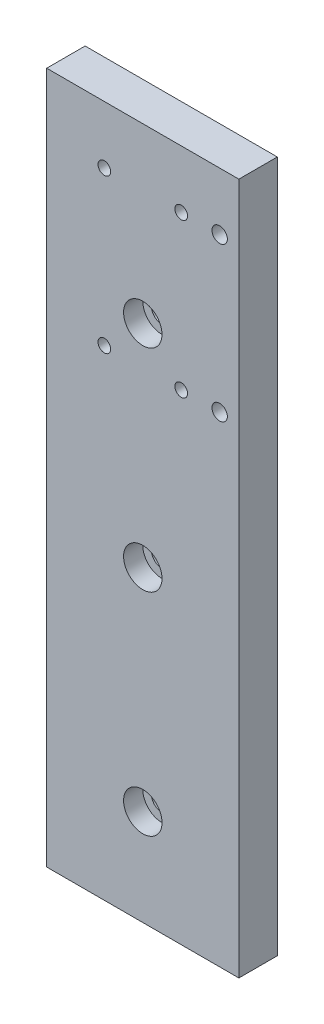
ISO-10303-21;
HEADER;
FILE_DESCRIPTION(('STEP AP214'),'2;1');
FILE_NAME('part.step','',(''),(''),'','','');
FILE_SCHEMA(('AUTOMOTIVE_DESIGN { 1 0 10303 214 1 1 1 1 }'));
ENDSEC;
DATA;
#1=APPLICATION_CONTEXT('core data for automotive mechanical design processes');
#2=APPLICATION_PROTOCOL_DEFINITION('international standard','automotive_design',2000,#1);
#3=PRODUCT_CONTEXT('',#1,'mechanical');
#4=PRODUCT('Part','Part','',(#3));
#5=PRODUCT_RELATED_PRODUCT_CATEGORY('part','',(#4));
#6=PRODUCT_DEFINITION_FORMATION('','',#4);
#7=PRODUCT_DEFINITION_CONTEXT('part definition',#1,'design');
#8=PRODUCT_DEFINITION('design','',#6,#7);
#9=PRODUCT_DEFINITION_SHAPE('','',#8);
#10=(LENGTH_UNIT() NAMED_UNIT(*) SI_UNIT(.MILLI.,.METRE.));
#11=(NAMED_UNIT(*) PLANE_ANGLE_UNIT() SI_UNIT($,.RADIAN.));
#12=(NAMED_UNIT(*) SI_UNIT($,.STERADIAN.) SOLID_ANGLE_UNIT());
#13=UNCERTAINTY_MEASURE_WITH_UNIT(LENGTH_MEASURE(1.E-05),#10,'distance_accuracy_value','');
#14=(GEOMETRIC_REPRESENTATION_CONTEXT(3) GLOBAL_UNCERTAINTY_ASSIGNED_CONTEXT((#13)) GLOBAL_UNIT_ASSIGNED_CONTEXT((#10,
#11,#12)) REPRESENTATION_CONTEXT('',''));
#15=CARTESIAN_POINT('',(0.,0.,0.));
#16=DIRECTION('',(0.,0.,1.));
#17=DIRECTION('',(1.,0.,0.));
#18=AXIS2_PLACEMENT_3D('',#15,#16,#17);
#19=CARTESIAN_POINT('',(-10.9813084112149,-119.193925233645,10.));
#20=DIRECTION('',(0.,0.,-1.));
#21=DIRECTION('',(-1.,0.,0.));
#22=AXIS2_PLACEMENT_3D('',#19,#20,#21);
#23=CYLINDRICAL_SURFACE('',#22,2.75);
#24=CARTESIAN_POINT('',(-10.9813084112149,-119.193925233645,0.));
#25=DIRECTION('',(0.,0.,1.));
#26=DIRECTION('',(1.,0.,0.));
#27=AXIS2_PLACEMENT_3D('',#24,#25,#26);
#28=CIRCLE('',#27,2.75);
#29=CARTESIAN_POINT('',(-8.23130841121492,-119.193925233645,0.));
#30=VERTEX_POINT('',#29);
#31=EDGE_CURVE('E175',#30,#30,#28,.T.);
#32=ORIENTED_EDGE('',*,*,#31,.F.);
#33=EDGE_LOOP('',(#32));
#34=FACE_BOUND('',#33,.T.);
#35=CARTESIAN_POINT('',(-10.9813084112149,-119.193925233645,5.));
#36=DIRECTION('',(0.,0.,1.));
#37=DIRECTION('',(1.,0.,0.));
#38=AXIS2_PLACEMENT_3D('',#35,#36,#37);
#39=CIRCLE('',#38,2.75);
#40=CARTESIAN_POINT('',(-8.23130841121492,-119.193925233645,5.));
#41=VERTEX_POINT('',#40);
#42=EDGE_CURVE('E39',#41,#41,#39,.T.);
#43=ORIENTED_EDGE('',*,*,#42,.T.);
#44=EDGE_LOOP('',(#43));
#45=FACE_BOUND('',#44,.T.);
#46=ADVANCED_FACE('F35',(#34,#45),#23,.F.);
#47=CARTESIAN_POINT('',(-10.9813084112149,-64.1939252336448,10.));
#48=DIRECTION('',(0.,0.,-1.));
#49=DIRECTION('',(-1.,0.,0.));
#50=AXIS2_PLACEMENT_3D('',#47,#48,#49);
#51=CYLINDRICAL_SURFACE('',#50,2.75);
#52=CARTESIAN_POINT('',(-10.9813084112149,-64.1939252336448,0.));
#53=DIRECTION('',(0.,0.,1.));
#54=DIRECTION('',(1.,0.,0.));
#55=AXIS2_PLACEMENT_3D('',#52,#53,#54);
#56=CIRCLE('',#55,2.75);
#57=CARTESIAN_POINT('',(-8.23130841121492,-64.1939252336448,0.));
#58=VERTEX_POINT('',#57);
#59=EDGE_CURVE('E172',#58,#58,#56,.T.);
#60=ORIENTED_EDGE('',*,*,#59,.F.);
#61=EDGE_LOOP('',(#60));
#62=FACE_BOUND('',#61,.T.);
#63=CARTESIAN_POINT('',(-10.9813084112149,-64.1939252336448,5.));
#64=DIRECTION('',(0.,0.,1.));
#65=DIRECTION('',(1.,0.,0.));
#66=AXIS2_PLACEMENT_3D('',#63,#64,#65);
#67=CIRCLE('',#66,2.75);
#68=CARTESIAN_POINT('',(-8.23130841121492,-64.1939252336448,5.));
#69=VERTEX_POINT('',#68);
#70=EDGE_CURVE('E141',#69,#69,#67,.T.);
#71=ORIENTED_EDGE('',*,*,#70,.T.);
#72=EDGE_LOOP('',(#71));
#73=FACE_BOUND('',#72,.T.);
#74=ADVANCED_FACE('F252',(#62,#73),#51,.F.);
#75=CARTESIAN_POINT('',(-10.9813084112149,-9.19392523364485,10.));
#76=DIRECTION('',(0.,0.,-1.));
#77=DIRECTION('',(-1.,0.,0.));
#78=AXIS2_PLACEMENT_3D('',#75,#76,#77);
#79=CYLINDRICAL_SURFACE('',#78,2.75);
#80=CARTESIAN_POINT('',(-10.9813084112149,-9.19392523364485,0.));
#81=DIRECTION('',(0.,0.,1.));
#82=DIRECTION('',(1.,0.,0.));
#83=AXIS2_PLACEMENT_3D('',#80,#81,#82);
#84=CIRCLE('',#83,2.75);
#85=CARTESIAN_POINT('',(-8.23130841121492,-9.19392523364485,0.));
#86=VERTEX_POINT('',#85);
#87=EDGE_CURVE('E167',#86,#86,#84,.T.);
#88=ORIENTED_EDGE('',*,*,#87,.F.);
#89=EDGE_LOOP('',(#88));
#90=FACE_BOUND('',#89,.T.);
#91=CARTESIAN_POINT('',(-10.9813084112149,-9.19392523364485,5.));
#92=DIRECTION('',(0.,0.,1.));
#93=DIRECTION('',(1.,0.,0.));
#94=AXIS2_PLACEMENT_3D('',#91,#92,#93);
#95=CIRCLE('',#94,2.75);
#96=CARTESIAN_POINT('',(-8.23130841121492,-9.19392523364485,5.));
#97=VERTEX_POINT('',#96);
#98=EDGE_CURVE('E153',#97,#97,#95,.T.);
#99=ORIENTED_EDGE('',*,*,#98,.T.);
#100=EDGE_LOOP('',(#99));
#101=FACE_BOUND('',#100,.T.);
#102=ADVANCED_FACE('F222',(#90,#101),#79,.F.);
#103=CARTESIAN_POINT('',(0.,0.,10.));
#104=DIRECTION('',(0.,0.,1.));
#105=DIRECTION('',(1.,0.,0.));
#106=AXIS2_PLACEMENT_3D('',#103,#104,#105);
#107=PLANE('',#106);
#108=CARTESIAN_POINT('',(-0.981308411214941,-19.1939252336449,10.));
#109=DIRECTION('',(0.,0.,1.));
#110=DIRECTION('',(1.,0.,0.));
#111=AXIS2_PLACEMENT_3D('',#108,#109,#110);
#112=CIRCLE('',#111,1.64999999999999);
#113=CARTESIAN_POINT('',(0.668691588785048,-19.1939252336449,10.));
#114=VERTEX_POINT('',#113);
#115=EDGE_CURVE('E113',#114,#114,#112,.T.);
#116=ORIENTED_EDGE('',*,*,#115,.F.);
#117=EDGE_LOOP('',(#116));
#118=FACE_BOUND('',#117,.T.);
#119=CARTESIAN_POINT('',(-20.9813084112149,-19.1939252336449,10.));
#120=DIRECTION('',(0.,0.,1.));
#121=DIRECTION('',(1.,0.,0.));
#122=AXIS2_PLACEMENT_3D('',#119,#120,#121);
#123=CIRCLE('',#122,1.64999999999999);
#124=CARTESIAN_POINT('',(-19.331308411215,-19.1939252336449,10.));
#125=VERTEX_POINT('',#124);
#126=EDGE_CURVE('E119',#125,#125,#123,.T.);
#127=ORIENTED_EDGE('',*,*,#126,.F.);
#128=EDGE_LOOP('',(#127));
#129=FACE_BOUND('',#128,.T.);
#130=CARTESIAN_POINT('',(-20.9813084112149,20.8060747663551,10.));
#131=DIRECTION('',(0.,0.,1.));
#132=DIRECTION('',(1.,0.,0.));
#133=AXIS2_PLACEMENT_3D('',#130,#131,#132);
#134=CIRCLE('',#133,1.64999999999999);
#135=CARTESIAN_POINT('',(-19.331308411215,20.8060747663551,10.));
#136=VERTEX_POINT('',#135);
#137=EDGE_CURVE('E125',#136,#136,#134,.T.);
#138=ORIENTED_EDGE('',*,*,#137,.F.);
#139=EDGE_LOOP('',(#138));
#140=FACE_BOUND('',#139,.T.);
#141=CARTESIAN_POINT('',(-0.981308411214941,20.8060747663551,10.));
#142=DIRECTION('',(0.,0.,1.));
#143=DIRECTION('',(1.,0.,0.));
#144=AXIS2_PLACEMENT_3D('',#141,#142,#143);
#145=CIRCLE('',#144,1.64999999999999);
#146=CARTESIAN_POINT('',(0.668691588785048,20.8060747663551,10.));
#147=VERTEX_POINT('',#146);
#148=EDGE_CURVE('E131',#147,#147,#145,.T.);
#149=ORIENTED_EDGE('',*,*,#148,.F.);
#150=EDGE_LOOP('',(#149));
#151=FACE_BOUND('',#150,.T.);
#152=CARTESIAN_POINT('',(-10.9813084112149,-64.1939252336448,10.));
#153=DIRECTION('',(0.,0.,1.));
#154=DIRECTION('',(1.,0.,0.));
#155=AXIS2_PLACEMENT_3D('',#152,#153,#154);
#156=CIRCLE('',#155,5.);
#157=CARTESIAN_POINT('',(-5.98130841121492,-64.1939252336448,10.));
#158=VERTEX_POINT('',#157);
#159=EDGE_CURVE('E142',#158,#158,#156,.T.);
#160=ORIENTED_EDGE('',*,*,#159,.F.);
#161=EDGE_LOOP('',(#160));
#162=FACE_BOUND('',#161,.T.);
#163=CARTESIAN_POINT('',(-10.9813084112149,-119.193925233645,10.));
#164=DIRECTION('',(0.,0.,1.));
#165=DIRECTION('',(1.,0.,0.));
#166=AXIS2_PLACEMENT_3D('',#163,#164,#165);
#167=CIRCLE('',#166,5.);
#168=CARTESIAN_POINT('',(-5.98130841121491,-119.193925233645,10.));
#169=VERTEX_POINT('',#168);
#170=EDGE_CURVE('E137',#169,#169,#167,.T.);
#171=ORIENTED_EDGE('',*,*,#170,.F.);
#172=EDGE_LOOP('',(#171));
#173=FACE_BOUND('',#172,.T.);
#174=CARTESIAN_POINT('',(-10.9813084112149,-9.19392523364485,10.));
#175=DIRECTION('',(0.,0.,1.));
#176=DIRECTION('',(1.,0.,0.));
#177=AXIS2_PLACEMENT_3D('',#174,#175,#176);
#178=CIRCLE('',#177,5.);
#179=CARTESIAN_POINT('',(-5.98130841121492,-9.19392523364485,10.));
#180=VERTEX_POINT('',#179);
#181=EDGE_CURVE('E154',#180,#180,#178,.T.);
#182=ORIENTED_EDGE('',*,*,#181,.F.);
#183=EDGE_LOOP('',(#182));
#184=FACE_BOUND('',#183,.T.);
#185=CARTESIAN_POINT('',(9.01869158878506,20.8060747663551,10.));
#186=DIRECTION('',(0.,0.,1.));
#187=DIRECTION('',(1.,0.,0.));
#188=AXIS2_PLACEMENT_3D('',#185,#186,#187);
#189=CIRCLE('',#188,2.);
#190=CARTESIAN_POINT('',(11.0186915887851,20.8060747663551,10.));
#191=VERTEX_POINT('',#190);
#192=EDGE_CURVE('E164',#191,#191,#189,.T.);
#193=ORIENTED_EDGE('',*,*,#192,.F.);
#194=EDGE_LOOP('',(#193));
#195=FACE_BOUND('',#194,.T.);
#196=DIRECTION('',(0.,1.,0.));
#197=VECTOR('',#196,1.);
#198=CARTESIAN_POINT('',(14.0186915887851,35.8060747663551,10.));
#199=LINE('',#198,#197);
#200=CARTESIAN_POINT('',(14.0186915887851,-144.193925233645,10.));
#201=VERTEX_POINT('',#200);
#202=CARTESIAN_POINT('',(14.0186915887851,35.8060747663551,10.));
#203=VERTEX_POINT('',#202);
#204=EDGE_CURVE('E179',#201,#203,#199,.T.);
#205=ORIENTED_EDGE('',*,*,#204,.T.);
#206=DIRECTION('',(-1.,0.,0.));
#207=VECTOR('',#206,1.);
#208=CARTESIAN_POINT('',(-35.9813084112149,35.8060747663551,10.));
#209=LINE('',#208,#207);
#210=CARTESIAN_POINT('',(-35.9813084112149,35.8060747663551,10.));
#211=VERTEX_POINT('',#210);
#212=EDGE_CURVE('E85',#203,#211,#209,.T.);
#213=ORIENTED_EDGE('',*,*,#212,.T.);
#214=DIRECTION('',(0.,-1.,0.));
#215=VECTOR('',#214,1.);
#216=CARTESIAN_POINT('',(-35.9813084112149,35.8060747663551,10.));
#217=LINE('',#216,#215);
#218=CARTESIAN_POINT('',(-35.9813084112149,-144.193925233645,10.));
#219=VERTEX_POINT('',#218);
#220=EDGE_CURVE('E182',#211,#219,#217,.T.);
#221=ORIENTED_EDGE('',*,*,#220,.T.);
#222=DIRECTION('',(1.,0.,0.));
#223=VECTOR('',#222,1.);
#224=CARTESIAN_POINT('',(-35.9813084112149,-144.193925233645,10.));
#225=LINE('',#224,#223);
#226=EDGE_CURVE('E54',#219,#201,#225,.T.);
#227=ORIENTED_EDGE('',*,*,#226,.T.);
#228=EDGE_LOOP('',(#205,#213,#221,#227));
#229=FACE_BOUND('',#228,.T.);
#230=CARTESIAN_POINT('',(9.01869158878506,-19.1939252336449,10.));
#231=DIRECTION('',(0.,0.,1.));
#232=DIRECTION('',(1.,0.,0.));
#233=AXIS2_PLACEMENT_3D('',#230,#231,#232);
#234=CIRCLE('',#233,2.);
#235=CARTESIAN_POINT('',(11.0186915887851,-19.1939252336449,10.));
#236=VERTEX_POINT('',#235);
#237=EDGE_CURVE('E157',#236,#236,#234,.T.);
#238=ORIENTED_EDGE('',*,*,#237,.F.);
#239=EDGE_LOOP('',(#238));
#240=FACE_BOUND('',#239,.T.);
#241=ADVANCED_FACE('F218',(#118,#129,#140,#151,#162,#173,#184,#195,#229,#240),#107,.T.);
#242=CARTESIAN_POINT('',(0.,0.,0.));
#243=DIRECTION('',(0.,0.,1.));
#244=DIRECTION('',(1.,0.,0.));
#245=AXIS2_PLACEMENT_3D('',#242,#243,#244);
#246=PLANE('',#245);
#247=CARTESIAN_POINT('',(-0.981308411214941,-19.1939252336449,0.));
#248=DIRECTION('',(0.,0.,1.));
#249=DIRECTION('',(1.,0.,0.));
#250=AXIS2_PLACEMENT_3D('',#247,#248,#249);
#251=CIRCLE('',#250,1.65);
#252=CARTESIAN_POINT('',(0.668691588785057,-19.1939252336449,0.));
#253=VERTEX_POINT('',#252);
#254=EDGE_CURVE('E116',#253,#253,#251,.T.);
#255=ORIENTED_EDGE('',*,*,#254,.T.);
#256=EDGE_LOOP('',(#255));
#257=FACE_BOUND('',#256,.T.);
#258=CARTESIAN_POINT('',(-20.9813084112149,-19.1939252336449,0.));
#259=DIRECTION('',(0.,0.,1.));
#260=DIRECTION('',(1.,0.,0.));
#261=AXIS2_PLACEMENT_3D('',#258,#259,#260);
#262=CIRCLE('',#261,1.65);
#263=CARTESIAN_POINT('',(-19.3313084112149,-19.1939252336449,0.));
#264=VERTEX_POINT('',#263);
#265=EDGE_CURVE('E122',#264,#264,#262,.T.);
#266=ORIENTED_EDGE('',*,*,#265,.T.);
#267=EDGE_LOOP('',(#266));
#268=FACE_BOUND('',#267,.T.);
#269=CARTESIAN_POINT('',(-20.9813084112149,20.8060747663551,0.));
#270=DIRECTION('',(0.,0.,1.));
#271=DIRECTION('',(1.,0.,0.));
#272=AXIS2_PLACEMENT_3D('',#269,#270,#271);
#273=CIRCLE('',#272,1.65);
#274=CARTESIAN_POINT('',(-19.3313084112149,20.8060747663551,0.));
#275=VERTEX_POINT('',#274);
#276=EDGE_CURVE('E128',#275,#275,#273,.T.);
#277=ORIENTED_EDGE('',*,*,#276,.T.);
#278=EDGE_LOOP('',(#277));
#279=FACE_BOUND('',#278,.T.);
#280=CARTESIAN_POINT('',(-0.981308411214941,20.8060747663551,0.));
#281=DIRECTION('',(0.,0.,1.));
#282=DIRECTION('',(1.,0.,0.));
#283=AXIS2_PLACEMENT_3D('',#280,#281,#282);
#284=CIRCLE('',#283,1.65);
#285=CARTESIAN_POINT('',(0.668691588785057,20.8060747663551,0.));
#286=VERTEX_POINT('',#285);
#287=EDGE_CURVE('E134',#286,#286,#284,.T.);
#288=ORIENTED_EDGE('',*,*,#287,.T.);
#289=EDGE_LOOP('',(#288));
#290=FACE_BOUND('',#289,.T.);
#291=DIRECTION('',(0.,1.,0.));
#292=VECTOR('',#291,1.);
#293=CARTESIAN_POINT('',(14.0186915887851,35.8060747663551,0.));
#294=LINE('',#293,#292);
#295=CARTESIAN_POINT('',(14.0186915887851,-144.193925233645,0.));
#296=VERTEX_POINT('',#295);
#297=CARTESIAN_POINT('',(14.0186915887851,35.8060747663551,0.));
#298=VERTEX_POINT('',#297);
#299=EDGE_CURVE('E178',#296,#298,#294,.T.);
#300=ORIENTED_EDGE('',*,*,#299,.F.);
#301=DIRECTION('',(1.,0.,0.));
#302=VECTOR('',#301,1.);
#303=CARTESIAN_POINT('',(-35.9813084112149,-144.193925233645,0.));
#304=LINE('',#303,#302);
#305=CARTESIAN_POINT('',(-35.9813084112149,-144.193925233645,0.));
#306=VERTEX_POINT('',#305);
#307=EDGE_CURVE('E78',#306,#296,#304,.T.);
#308=ORIENTED_EDGE('',*,*,#307,.F.);
#309=DIRECTION('',(0.,-1.,0.));
#310=VECTOR('',#309,1.);
#311=CARTESIAN_POINT('',(-35.9813084112149,35.8060747663551,0.));
#312=LINE('',#311,#310);
#313=CARTESIAN_POINT('',(-35.9813084112149,35.8060747663551,0.));
#314=VERTEX_POINT('',#313);
#315=EDGE_CURVE('E72',#314,#306,#312,.T.);
#316=ORIENTED_EDGE('',*,*,#315,.F.);
#317=DIRECTION('',(-1.,0.,0.));
#318=VECTOR('',#317,1.);
#319=CARTESIAN_POINT('',(-35.9813084112149,35.8060747663551,0.));
#320=LINE('',#319,#318);
#321=EDGE_CURVE('E188',#298,#314,#320,.T.);
#322=ORIENTED_EDGE('',*,*,#321,.F.);
#323=EDGE_LOOP('',(#300,#308,#316,#322));
#324=FACE_BOUND('',#323,.T.);
#325=ORIENTED_EDGE('',*,*,#31,.T.);
#326=EDGE_LOOP('',(#325));
#327=FACE_BOUND('',#326,.T.);
#328=ORIENTED_EDGE('',*,*,#59,.T.);
#329=EDGE_LOOP('',(#328));
#330=FACE_BOUND('',#329,.T.);
#331=ORIENTED_EDGE('',*,*,#87,.T.);
#332=EDGE_LOOP('',(#331));
#333=FACE_BOUND('',#332,.T.);
#334=CARTESIAN_POINT('',(9.01869158878506,20.8060747663551,0.));
#335=DIRECTION('',(0.,0.,1.));
#336=DIRECTION('',(1.,0.,0.));
#337=AXIS2_PLACEMENT_3D('',#334,#335,#336);
#338=CIRCLE('',#337,2.);
#339=CARTESIAN_POINT('',(11.0186915887851,20.8060747663551,0.));
#340=VERTEX_POINT('',#339);
#341=EDGE_CURVE('E160',#340,#340,#338,.T.);
#342=ORIENTED_EDGE('',*,*,#341,.T.);
#343=EDGE_LOOP('',(#342));
#344=FACE_BOUND('',#343,.T.);
#345=CARTESIAN_POINT('',(9.01869158878506,-19.1939252336449,0.));
#346=DIRECTION('',(0.,0.,1.));
#347=DIRECTION('',(1.,0.,0.));
#348=AXIS2_PLACEMENT_3D('',#345,#346,#347);
#349=CIRCLE('',#348,2.);
#350=CARTESIAN_POINT('',(11.0186915887851,-19.1939252336449,0.));
#351=VERTEX_POINT('',#350);
#352=EDGE_CURVE('E161',#351,#351,#349,.T.);
#353=ORIENTED_EDGE('',*,*,#352,.T.);
#354=EDGE_LOOP('',(#353));
#355=FACE_BOUND('',#354,.T.);
#356=ADVANCED_FACE('F221',(#257,#268,#279,#290,#324,#327,#330,#333,#344,#355),#246,.F.);
#357=CARTESIAN_POINT('',(14.0186915887851,35.8060747663551,10.));
#358=DIRECTION('',(-1.,0.,0.));
#359=DIRECTION('',(0.,-1.,0.));
#360=AXIS2_PLACEMENT_3D('',#357,#358,#359);
#361=PLANE('',#360);
#362=ORIENTED_EDGE('',*,*,#299,.T.);
#363=DIRECTION('',(0.,0.,-1.));
#364=VECTOR('',#363,1.);
#365=CARTESIAN_POINT('',(14.0186915887851,35.8060747663551,10.));
#366=LINE('',#365,#364);
#367=EDGE_CURVE('E11',#203,#298,#366,.T.);
#368=ORIENTED_EDGE('',*,*,#367,.F.);
#369=ORIENTED_EDGE('',*,*,#204,.F.);
#370=DIRECTION('',(0.,0.,-1.));
#371=VECTOR('',#370,1.);
#372=CARTESIAN_POINT('',(14.0186915887851,-144.193925233645,10.));
#373=LINE('',#372,#371);
#374=EDGE_CURVE('E185',#201,#296,#373,.T.);
#375=ORIENTED_EDGE('',*,*,#374,.T.);
#376=EDGE_LOOP('',(#362,#368,#369,#375));
#377=FACE_BOUND('',#376,.T.);
#378=ADVANCED_FACE('F37',(#377),#361,.F.);
#379=CARTESIAN_POINT('',(-35.9813084112149,35.8060747663551,10.));
#380=DIRECTION('',(0.,-1.,0.));
#381=DIRECTION('',(0.,0.,-1.));
#382=AXIS2_PLACEMENT_3D('',#379,#380,#381);
#383=PLANE('',#382);
#384=ORIENTED_EDGE('',*,*,#321,.T.);
#385=DIRECTION('',(0.,0.,-1.));
#386=VECTOR('',#385,1.);
#387=CARTESIAN_POINT('',(-35.9813084112149,35.8060747663551,10.));
#388=LINE('',#387,#386);
#389=EDGE_CURVE('E45',#211,#314,#388,.T.);
#390=ORIENTED_EDGE('',*,*,#389,.F.);
#391=ORIENTED_EDGE('',*,*,#212,.F.);
#392=ORIENTED_EDGE('',*,*,#367,.T.);
#393=EDGE_LOOP('',(#384,#390,#391,#392));
#394=FACE_BOUND('',#393,.T.);
#395=ADVANCED_FACE('F247',(#394),#383,.F.);
#396=CARTESIAN_POINT('',(-35.9813084112149,35.8060747663551,10.));
#397=DIRECTION('',(1.,0.,0.));
#398=DIRECTION('',(0.,1.,0.));
#399=AXIS2_PLACEMENT_3D('',#396,#397,#398);
#400=PLANE('',#399);
#401=ORIENTED_EDGE('',*,*,#315,.T.);
#402=DIRECTION('',(0.,0.,-1.));
#403=VECTOR('',#402,1.);
#404=CARTESIAN_POINT('',(-35.9813084112149,-144.193925233645,10.));
#405=LINE('',#404,#403);
#406=EDGE_CURVE('E193',#219,#306,#405,.T.);
#407=ORIENTED_EDGE('',*,*,#406,.F.);
#408=ORIENTED_EDGE('',*,*,#220,.F.);
#409=ORIENTED_EDGE('',*,*,#389,.T.);
#410=EDGE_LOOP('',(#401,#407,#408,#409));
#411=FACE_BOUND('',#410,.T.);
#412=ADVANCED_FACE('F313',(#411),#400,.F.);
#413=CARTESIAN_POINT('',(-35.9813084112149,-144.193925233645,10.));
#414=DIRECTION('',(0.,1.,0.));
#415=DIRECTION('',(0.,0.,1.));
#416=AXIS2_PLACEMENT_3D('',#413,#414,#415);
#417=PLANE('',#416);
#418=CARTESIAN_POINT('',(-29.9813084112149,-144.193925233645,5.));
#419=DIRECTION('',(0.,-1.,0.));
#420=DIRECTION('',(0.,0.,-1.));
#421=AXIS2_PLACEMENT_3D('',#418,#419,#420);
#422=CIRCLE('',#421,1.64999999999999);
#423=CARTESIAN_POINT('',(-29.9813084112149,-144.193925233645,3.35000000000001));
#424=VERTEX_POINT('',#423);
#425=EDGE_CURVE('E103',#424,#424,#422,.T.);
#426=ORIENTED_EDGE('',*,*,#425,.F.);
#427=EDGE_LOOP('',(#426));
#428=FACE_BOUND('',#427,.T.);
#429=CARTESIAN_POINT('',(8.01869158878509,-144.193925233645,5.));
#430=DIRECTION('',(0.,-1.,0.));
#431=DIRECTION('',(0.,0.,-1.));
#432=AXIS2_PLACEMENT_3D('',#429,#430,#431);
#433=CIRCLE('',#432,1.64999999999999);
#434=CARTESIAN_POINT('',(8.01869158878509,-144.193925233645,3.35000000000001));
#435=VERTEX_POINT('',#434);
#436=EDGE_CURVE('E102',#435,#435,#433,.T.);
#437=ORIENTED_EDGE('',*,*,#436,.F.);
#438=EDGE_LOOP('',(#437));
#439=FACE_BOUND('',#438,.T.);
#440=ORIENTED_EDGE('',*,*,#307,.T.);
#441=ORIENTED_EDGE('',*,*,#374,.F.);
#442=ORIENTED_EDGE('',*,*,#226,.F.);
#443=ORIENTED_EDGE('',*,*,#406,.T.);
#444=EDGE_LOOP('',(#440,#441,#442,#443));
#445=FACE_BOUND('',#444,.T.);
#446=ADVANCED_FACE('F266',(#428,#439,#445),#417,.F.);
#447=CARTESIAN_POINT('',(9.01869158878506,20.8060747663551,10.));
#448=DIRECTION('',(0.,0.,-1.));
#449=DIRECTION('',(-1.,0.,0.));
#450=AXIS2_PLACEMENT_3D('',#447,#448,#449);
#451=CYLINDRICAL_SURFACE('',#450,2.);
#452=ORIENTED_EDGE('',*,*,#192,.T.);
#453=EDGE_LOOP('',(#452));
#454=FACE_BOUND('',#453,.T.);
#455=ORIENTED_EDGE('',*,*,#341,.F.);
#456=EDGE_LOOP('',(#455));
#457=FACE_BOUND('',#456,.T.);
#458=ADVANCED_FACE('F237',(#454,#457),#451,.F.);
#459=CARTESIAN_POINT('',(9.01869158878506,-19.1939252336449,10.));
#460=DIRECTION('',(0.,0.,-1.));
#461=DIRECTION('',(-1.,0.,0.));
#462=AXIS2_PLACEMENT_3D('',#459,#460,#461);
#463=CYLINDRICAL_SURFACE('',#462,2.);
#464=ORIENTED_EDGE('',*,*,#237,.T.);
#465=EDGE_LOOP('',(#464));
#466=FACE_BOUND('',#465,.T.);
#467=ORIENTED_EDGE('',*,*,#352,.F.);
#468=EDGE_LOOP('',(#467));
#469=FACE_BOUND('',#468,.T.);
#470=ADVANCED_FACE('F233',(#466,#469),#463,.F.);
#471=CARTESIAN_POINT('',(-10.9813084112149,-9.19392523364485,5.));
#472=DIRECTION('',(0.,0.,1.));
#473=DIRECTION('',(1.,0.,0.));
#474=AXIS2_PLACEMENT_3D('',#471,#472,#473);
#475=CYLINDRICAL_SURFACE('',#474,5.);
#476=CARTESIAN_POINT('',(-10.9813084112149,-9.19392523364485,5.));
#477=DIRECTION('',(0.,0.,1.));
#478=DIRECTION('',(1.,0.,0.));
#479=AXIS2_PLACEMENT_3D('',#476,#477,#478);
#480=CIRCLE('',#479,5.);
#481=CARTESIAN_POINT('',(-5.98130841121492,-9.19392523364485,5.));
#482=VERTEX_POINT('',#481);
#483=EDGE_CURVE('E150',#482,#482,#480,.T.);
#484=ORIENTED_EDGE('',*,*,#483,.F.);
#485=EDGE_LOOP('',(#484));
#486=FACE_BOUND('',#485,.T.);
#487=ORIENTED_EDGE('',*,*,#181,.T.);
#488=EDGE_LOOP('',(#487));
#489=FACE_BOUND('',#488,.T.);
#490=ADVANCED_FACE('F236',(#486,#489),#475,.F.);
#491=CARTESIAN_POINT('',(-10.9813084112149,-9.19392523364485,5.));
#492=DIRECTION('',(0.,0.,1.));
#493=DIRECTION('',(1.,0.,0.));
#494=AXIS2_PLACEMENT_3D('',#491,#492,#493);
#495=PLANE('',#494);
#496=ORIENTED_EDGE('',*,*,#98,.F.);
#497=EDGE_LOOP('',(#496));
#498=FACE_BOUND('',#497,.T.);
#499=ORIENTED_EDGE('',*,*,#483,.T.);
#500=EDGE_LOOP('',(#499));
#501=FACE_BOUND('',#500,.T.);
#502=ADVANCED_FACE('F271',(#498,#501),#495,.T.);
#503=CARTESIAN_POINT('',(-10.9813084112149,-64.1939252336448,5.));
#504=DIRECTION('',(0.,0.,1.));
#505=DIRECTION('',(1.,0.,0.));
#506=AXIS2_PLACEMENT_3D('',#503,#504,#505);
#507=CYLINDRICAL_SURFACE('',#506,5.);
#508=CARTESIAN_POINT('',(-10.9813084112149,-64.1939252336448,5.));
#509=DIRECTION('',(0.,0.,1.));
#510=DIRECTION('',(1.,0.,0.));
#511=AXIS2_PLACEMENT_3D('',#508,#509,#510);
#512=CIRCLE('',#511,5.);
#513=CARTESIAN_POINT('',(-5.98130841121492,-64.1939252336448,5.));
#514=VERTEX_POINT('',#513);
#515=EDGE_CURVE('E138',#514,#514,#512,.T.);
#516=ORIENTED_EDGE('',*,*,#515,.F.);
#517=EDGE_LOOP('',(#516));
#518=FACE_BOUND('',#517,.T.);
#519=ORIENTED_EDGE('',*,*,#159,.T.);
#520=EDGE_LOOP('',(#519));
#521=FACE_BOUND('',#520,.T.);
#522=ADVANCED_FACE('F274',(#518,#521),#507,.F.);
#523=CARTESIAN_POINT('',(-10.9813084112149,-64.1939252336448,5.));
#524=DIRECTION('',(0.,0.,1.));
#525=DIRECTION('',(1.,0.,0.));
#526=AXIS2_PLACEMENT_3D('',#523,#524,#525);
#527=PLANE('',#526);
#528=ORIENTED_EDGE('',*,*,#70,.F.);
#529=EDGE_LOOP('',(#528));
#530=FACE_BOUND('',#529,.T.);
#531=ORIENTED_EDGE('',*,*,#515,.T.);
#532=EDGE_LOOP('',(#531));
#533=FACE_BOUND('',#532,.T.);
#534=ADVANCED_FACE('F214',(#530,#533),#527,.T.);
#535=CARTESIAN_POINT('',(-10.9813084112149,-119.193925233645,5.));
#536=DIRECTION('',(0.,0.,1.));
#537=DIRECTION('',(1.,0.,0.));
#538=AXIS2_PLACEMENT_3D('',#535,#536,#537);
#539=CYLINDRICAL_SURFACE('',#538,5.);
#540=CARTESIAN_POINT('',(-10.9813084112149,-119.193925233645,5.));
#541=DIRECTION('',(0.,0.,1.));
#542=DIRECTION('',(1.,0.,0.));
#543=AXIS2_PLACEMENT_3D('',#540,#541,#542);
#544=CIRCLE('',#543,5.);
#545=CARTESIAN_POINT('',(-5.98130841121491,-119.193925233645,5.));
#546=VERTEX_POINT('',#545);
#547=EDGE_CURVE('E145',#546,#546,#544,.T.);
#548=ORIENTED_EDGE('',*,*,#547,.F.);
#549=EDGE_LOOP('',(#548));
#550=FACE_BOUND('',#549,.T.);
#551=ORIENTED_EDGE('',*,*,#170,.T.);
#552=EDGE_LOOP('',(#551));
#553=FACE_BOUND('',#552,.T.);
#554=ADVANCED_FACE('F208',(#550,#553),#539,.F.);
#555=CARTESIAN_POINT('',(-10.9813084112149,-119.193925233645,5.));
#556=DIRECTION('',(0.,0.,1.));
#557=DIRECTION('',(1.,0.,0.));
#558=AXIS2_PLACEMENT_3D('',#555,#556,#557);
#559=PLANE('',#558);
#560=ORIENTED_EDGE('',*,*,#42,.F.);
#561=EDGE_LOOP('',(#560));
#562=FACE_BOUND('',#561,.T.);
#563=ORIENTED_EDGE('',*,*,#547,.T.);
#564=EDGE_LOOP('',(#563));
#565=FACE_BOUND('',#564,.T.);
#566=ADVANCED_FACE('F204',(#562,#565),#559,.T.);
#567=CARTESIAN_POINT('',(-0.981308411214941,20.8060747663551,10.));
#568=DIRECTION('',(0.,0.,1.));
#569=DIRECTION('',(1.,0.,0.));
#570=AXIS2_PLACEMENT_3D('',#567,#568,#569);
#571=CYLINDRICAL_SURFACE('',#570,1.64999999999999);
#572=ORIENTED_EDGE('',*,*,#287,.F.);
#573=EDGE_LOOP('',(#572));
#574=FACE_BOUND('',#573,.T.);
#575=ORIENTED_EDGE('',*,*,#148,.T.);
#576=EDGE_LOOP('',(#575));
#577=FACE_BOUND('',#576,.T.);
#578=ADVANCED_FACE('F207',(#574,#577),#571,.F.);
#579=CARTESIAN_POINT('',(-20.9813084112149,20.8060747663551,10.));
#580=DIRECTION('',(0.,0.,1.));
#581=DIRECTION('',(1.,0.,0.));
#582=AXIS2_PLACEMENT_3D('',#579,#580,#581);
#583=CYLINDRICAL_SURFACE('',#582,1.64999999999999);
#584=ORIENTED_EDGE('',*,*,#276,.F.);
#585=EDGE_LOOP('',(#584));
#586=FACE_BOUND('',#585,.T.);
#587=ORIENTED_EDGE('',*,*,#137,.T.);
#588=EDGE_LOOP('',(#587));
#589=FACE_BOUND('',#588,.T.);
#590=ADVANCED_FACE('F285',(#586,#589),#583,.F.);
#591=CARTESIAN_POINT('',(-20.9813084112149,-19.1939252336449,10.));
#592=DIRECTION('',(0.,0.,1.));
#593=DIRECTION('',(1.,0.,0.));
#594=AXIS2_PLACEMENT_3D('',#591,#592,#593);
#595=CYLINDRICAL_SURFACE('',#594,1.64999999999999);
#596=ORIENTED_EDGE('',*,*,#265,.F.);
#597=EDGE_LOOP('',(#596));
#598=FACE_BOUND('',#597,.T.);
#599=ORIENTED_EDGE('',*,*,#126,.T.);
#600=EDGE_LOOP('',(#599));
#601=FACE_BOUND('',#600,.T.);
#602=ADVANCED_FACE('F289',(#598,#601),#595,.F.);
#603=CARTESIAN_POINT('',(-0.981308411214941,-19.1939252336449,10.));
#604=DIRECTION('',(0.,0.,1.));
#605=DIRECTION('',(1.,0.,0.));
#606=AXIS2_PLACEMENT_3D('',#603,#604,#605);
#607=CYLINDRICAL_SURFACE('',#606,1.64999999999999);
#608=ORIENTED_EDGE('',*,*,#254,.F.);
#609=EDGE_LOOP('',(#608));
#610=FACE_BOUND('',#609,.T.);
#611=ORIENTED_EDGE('',*,*,#115,.T.);
#612=EDGE_LOOP('',(#611));
#613=FACE_BOUND('',#612,.T.);
#614=ADVANCED_FACE('F293',(#610,#613),#607,.F.);
#615=CARTESIAN_POINT('',(8.01869158878509,-136.193925233645,5.));
#616=DIRECTION('',(0.,-1.,0.));
#617=DIRECTION('',(0.,0.,-1.));
#618=AXIS2_PLACEMENT_3D('',#615,#616,#617);
#619=CONICAL_SURFACE('',#618,1.65,1.02974425867666);
#620=CARTESIAN_POINT('',(8.01869158878508,-135.202505212249,5.));
#621=VERTEX_POINT('',#620);
#622=VERTEX_LOOP('',#621);
#623=FACE_BOUND('',#622,.T.);
#624=CARTESIAN_POINT('',(8.01869158878509,-136.193925233645,5.));
#625=DIRECTION('',(0.,-1.,0.));
#626=DIRECTION('',(0.,0.,-1.));
#627=AXIS2_PLACEMENT_3D('',#624,#625,#626);
#628=CIRCLE('',#627,1.65);
#629=CARTESIAN_POINT('',(8.01869158878509,-136.193925233645,3.35));
#630=VERTEX_POINT('',#629);
#631=EDGE_CURVE('E106',#630,#630,#628,.T.);
#632=ORIENTED_EDGE('',*,*,#631,.T.);
#633=EDGE_LOOP('',(#632));
#634=FACE_BOUND('',#633,.T.);
#635=ADVANCED_FACE('F297',(#623,#634),#619,.F.);
#636=CARTESIAN_POINT('',(8.01869158878509,-144.193925233645,5.));
#637=DIRECTION('',(0.,-1.,0.));
#638=DIRECTION('',(0.,0.,-1.));
#639=AXIS2_PLACEMENT_3D('',#636,#637,#638);
#640=CYLINDRICAL_SURFACE('',#639,1.64999999999999);
#641=ORIENTED_EDGE('',*,*,#631,.F.);
#642=EDGE_LOOP('',(#641));
#643=FACE_BOUND('',#642,.T.);
#644=ORIENTED_EDGE('',*,*,#436,.T.);
#645=EDGE_LOOP('',(#644));
#646=FACE_BOUND('',#645,.T.);
#647=ADVANCED_FACE('F96',(#643,#646),#640,.F.);
#648=CARTESIAN_POINT('',(-29.9813084112149,-136.193925233645,5.));
#649=DIRECTION('',(0.,-1.,0.));
#650=DIRECTION('',(0.,0.,-1.));
#651=AXIS2_PLACEMENT_3D('',#648,#649,#650);
#652=CONICAL_SURFACE('',#651,1.65,1.02974425867666);
#653=CARTESIAN_POINT('',(-29.9813084112149,-135.202505212249,5.));
#654=VERTEX_POINT('',#653);
#655=VERTEX_LOOP('',#654);
#656=FACE_BOUND('',#655,.T.);
#657=CARTESIAN_POINT('',(-29.9813084112149,-136.193925233645,5.));
#658=DIRECTION('',(0.,-1.,0.));
#659=DIRECTION('',(0.,0.,-1.));
#660=AXIS2_PLACEMENT_3D('',#657,#658,#659);
#661=CIRCLE('',#660,1.65);
#662=CARTESIAN_POINT('',(-29.9813084112149,-136.193925233645,3.35));
#663=VERTEX_POINT('',#662);
#664=EDGE_CURVE('E100',#663,#663,#661,.T.);
#665=ORIENTED_EDGE('',*,*,#664,.T.);
#666=EDGE_LOOP('',(#665));
#667=FACE_BOUND('',#666,.T.);
#668=ADVANCED_FACE('F92',(#656,#667),#652,.F.);
#669=CARTESIAN_POINT('',(-29.9813084112149,-144.193925233645,5.));
#670=DIRECTION('',(0.,-1.,0.));
#671=DIRECTION('',(0.,0.,-1.));
#672=AXIS2_PLACEMENT_3D('',#669,#670,#671);
#673=CYLINDRICAL_SURFACE('',#672,1.65);
#674=ORIENTED_EDGE('',*,*,#664,.F.);
#675=EDGE_LOOP('',(#674));
#676=FACE_BOUND('',#675,.T.);
#677=ORIENTED_EDGE('',*,*,#425,.T.);
#678=EDGE_LOOP('',(#677));
#679=FACE_BOUND('',#678,.T.);
#680=ADVANCED_FACE('F95',(#676,#679),#673,.F.);
#681=CLOSED_SHELL('',(#46,#74,#102,#241,#356,#378,#395,#412,#446,#458,#470,#490,#502,#522,#534,
#554,#566,#578,#590,#602,#614,#635,#647,#668,#680));
#682=MANIFOLD_SOLID_BREP('B2',#681);
#683=ADVANCED_BREP_SHAPE_REPRESENTATION('',(#18,#682),#14);
#684=SHAPE_DEFINITION_REPRESENTATION(#9,#683);
ENDSEC;
END-ISO-10303-21;
